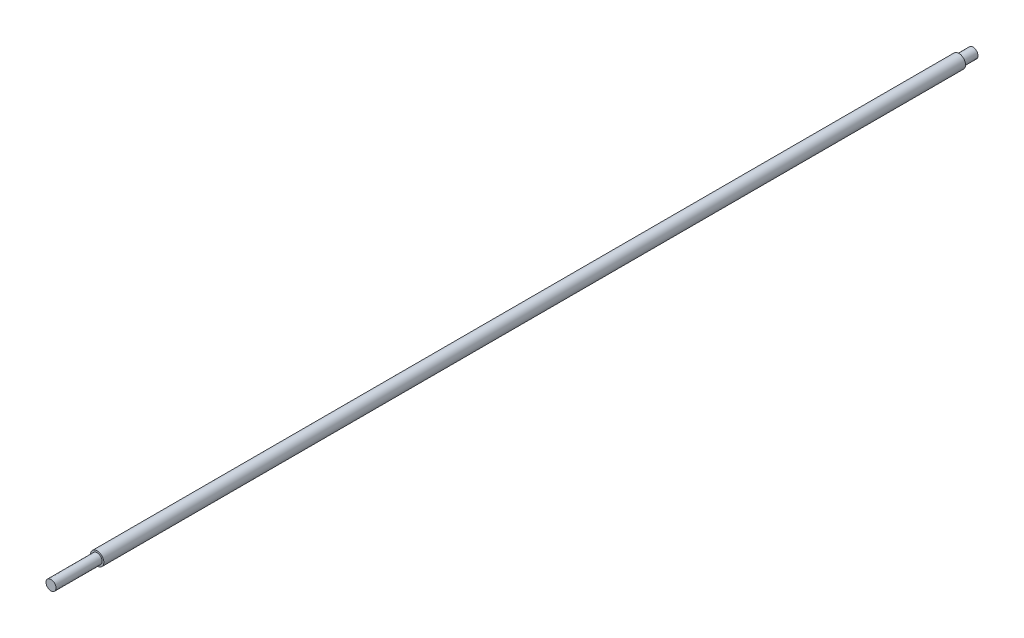
ISO-10303-21;
HEADER;
FILE_DESCRIPTION(('STEP AP214'),'2;1');
FILE_NAME('part.step','',(''),(''),'','','');
FILE_SCHEMA(('AUTOMOTIVE_DESIGN { 1 0 10303 214 1 1 1 1 }'));
ENDSEC;
DATA;
#1=APPLICATION_CONTEXT('core data for automotive mechanical design processes');
#2=APPLICATION_PROTOCOL_DEFINITION('international standard','automotive_design',2000,#1);
#3=PRODUCT_CONTEXT('',#1,'mechanical');
#4=PRODUCT('Part','Part','',(#3));
#5=PRODUCT_RELATED_PRODUCT_CATEGORY('part','',(#4));
#6=PRODUCT_DEFINITION_FORMATION('','',#4);
#7=PRODUCT_DEFINITION_CONTEXT('part definition',#1,'design');
#8=PRODUCT_DEFINITION('design','',#6,#7);
#9=PRODUCT_DEFINITION_SHAPE('','',#8);
#10=(LENGTH_UNIT() NAMED_UNIT(*) SI_UNIT(.MILLI.,.METRE.));
#11=(NAMED_UNIT(*) PLANE_ANGLE_UNIT() SI_UNIT($,.RADIAN.));
#12=(NAMED_UNIT(*) SI_UNIT($,.STERADIAN.) SOLID_ANGLE_UNIT());
#13=UNCERTAINTY_MEASURE_WITH_UNIT(LENGTH_MEASURE(1.E-05),#10,'distance_accuracy_value','');
#14=(GEOMETRIC_REPRESENTATION_CONTEXT(3) GLOBAL_UNCERTAINTY_ASSIGNED_CONTEXT((#13)) GLOBAL_UNIT_ASSIGNED_CONTEXT((#10,
#11,#12)) REPRESENTATION_CONTEXT('',''));
#15=CARTESIAN_POINT('',(0.,0.,0.));
#16=DIRECTION('',(0.,0.,1.));
#17=DIRECTION('',(1.,0.,0.));
#18=AXIS2_PLACEMENT_3D('',#15,#16,#17);
#19=CARTESIAN_POINT('',(0.,0.,1102.));
#20=DIRECTION('',(0.,0.,-1.));
#21=DIRECTION('',(-1.,0.,0.));
#22=AXIS2_PLACEMENT_3D('',#19,#20,#21);
#23=CYLINDRICAL_SURFACE('',#22,8.);
#24=CARTESIAN_POINT('',(0.,0.,1051.));
#25=DIRECTION('',(0.,0.,1.));
#26=DIRECTION('',(1.,0.,0.));
#27=AXIS2_PLACEMENT_3D('',#24,#25,#26);
#28=CIRCLE('',#27,8.);
#29=CARTESIAN_POINT('',(8.,0.,1051.));
#30=VERTEX_POINT('',#29);
#31=EDGE_CURVE('E46',#30,#30,#28,.T.);
#32=ORIENTED_EDGE('',*,*,#31,.F.);
#33=EDGE_LOOP('',(#32));
#34=FACE_BOUND('',#33,.T.);
#35=CARTESIAN_POINT('',(0.,0.,17.));
#36=DIRECTION('',(0.,0.,-1.));
#37=DIRECTION('',(-1.,0.,0.));
#38=AXIS2_PLACEMENT_3D('',#35,#36,#37);
#39=CIRCLE('',#38,8.);
#40=CARTESIAN_POINT('',(-8.,0.,17.));
#41=VERTEX_POINT('',#40);
#42=EDGE_CURVE('E49',#41,#41,#39,.T.);
#43=ORIENTED_EDGE('',*,*,#42,.F.);
#44=EDGE_LOOP('',(#43));
#45=FACE_BOUND('',#44,.T.);
#46=ADVANCED_FACE('F27',(#34,#45),#23,.T.);
#47=CARTESIAN_POINT('',(0.,0.,1051.));
#48=DIRECTION('',(0.,0.,1.));
#49=DIRECTION('',(1.,0.,0.));
#50=AXIS2_PLACEMENT_3D('',#47,#48,#49);
#51=PLANE('',#50);
#52=ORIENTED_EDGE('',*,*,#31,.T.);
#53=EDGE_LOOP('',(#52));
#54=FACE_BOUND('',#53,.T.);
#55=CARTESIAN_POINT('',(0.,0.,1051.));
#56=DIRECTION('',(0.,0.,1.));
#57=DIRECTION('',(1.,0.,0.));
#58=AXIS2_PLACEMENT_3D('',#55,#56,#57);
#59=CIRCLE('',#58,6.);
#60=CARTESIAN_POINT('',(6.,0.,1051.));
#61=VERTEX_POINT('',#60);
#62=EDGE_CURVE('E33',#61,#61,#59,.F.);
#63=ORIENTED_EDGE('',*,*,#62,.T.);
#64=EDGE_LOOP('',(#63));
#65=FACE_BOUND('',#64,.T.);
#66=ADVANCED_FACE('F56',(#54,#65),#51,.T.);
#67=CARTESIAN_POINT('',(0.,0.,1106.4));
#68=DIRECTION('',(0.,0.,1.));
#69=DIRECTION('',(1.,0.,0.));
#70=AXIS2_PLACEMENT_3D('',#67,#68,#69);
#71=PLANE('',#70);
#72=CARTESIAN_POINT('',(0.,0.,1106.4));
#73=DIRECTION('',(0.,0.,1.));
#74=DIRECTION('',(1.,0.,0.));
#75=AXIS2_PLACEMENT_3D('',#72,#73,#74);
#76=CIRCLE('',#75,6.);
#77=CARTESIAN_POINT('',(6.,0.,1106.4));
#78=VERTEX_POINT('',#77);
#79=EDGE_CURVE('E41',#78,#78,#76,.T.);
#80=ORIENTED_EDGE('',*,*,#79,.T.);
#81=EDGE_LOOP('',(#80));
#82=FACE_BOUND('',#81,.T.);
#83=ADVANCED_FACE('F63',(#82),#71,.T.);
#84=CARTESIAN_POINT('',(0.,0.,1048.));
#85=DIRECTION('',(0.,0.,1.));
#86=DIRECTION('',(1.,0.,0.));
#87=AXIS2_PLACEMENT_3D('',#84,#85,#86);
#88=CYLINDRICAL_SURFACE('',#87,6.);
#89=ORIENTED_EDGE('',*,*,#62,.F.);
#90=EDGE_LOOP('',(#89));
#91=FACE_BOUND('',#90,.T.);
#92=ORIENTED_EDGE('',*,*,#79,.F.);
#93=EDGE_LOOP('',(#92));
#94=FACE_BOUND('',#93,.T.);
#95=ADVANCED_FACE('F70',(#91,#94),#88,.T.);
#96=CARTESIAN_POINT('',(0.,0.,17.));
#97=DIRECTION('',(0.,0.,-1.));
#98=DIRECTION('',(-1.,0.,0.));
#99=AXIS2_PLACEMENT_3D('',#96,#97,#98);
#100=PLANE('',#99);
#101=ORIENTED_EDGE('',*,*,#42,.T.);
#102=EDGE_LOOP('',(#101));
#103=FACE_BOUND('',#102,.T.);
#104=CARTESIAN_POINT('',(0.,0.,17.));
#105=DIRECTION('',(0.,0.,-1.));
#106=DIRECTION('',(-1.,0.,0.));
#107=AXIS2_PLACEMENT_3D('',#104,#105,#106);
#108=CIRCLE('',#107,6.);
#109=CARTESIAN_POINT('',(-6.,0.,17.));
#110=VERTEX_POINT('',#109);
#111=EDGE_CURVE('E10',#110,#110,#108,.F.);
#112=ORIENTED_EDGE('',*,*,#111,.T.);
#113=EDGE_LOOP('',(#112));
#114=FACE_BOUND('',#113,.T.);
#115=ADVANCED_FACE('F53',(#103,#114),#100,.T.);
#116=CARTESIAN_POINT('',(0.,0.,0.));
#117=DIRECTION('',(0.,0.,1.));
#118=DIRECTION('',(1.,0.,0.));
#119=AXIS2_PLACEMENT_3D('',#116,#117,#118);
#120=PLANE('',#119);
#121=CARTESIAN_POINT('',(0.,0.,0.));
#122=DIRECTION('',(0.,0.,-1.));
#123=DIRECTION('',(-1.,0.,0.));
#124=AXIS2_PLACEMENT_3D('',#121,#122,#123);
#125=CIRCLE('',#124,6.);
#126=CARTESIAN_POINT('',(-6.,0.,0.));
#127=VERTEX_POINT('',#126);
#128=EDGE_CURVE('E37',#127,#127,#125,.T.);
#129=ORIENTED_EDGE('',*,*,#128,.T.);
#130=EDGE_LOOP('',(#129));
#131=FACE_BOUND('',#130,.T.);
#132=ADVANCED_FACE('F78',(#131),#120,.F.);
#133=CARTESIAN_POINT('',(0.,0.,20.));
#134=DIRECTION('',(0.,0.,-1.));
#135=DIRECTION('',(-1.,0.,0.));
#136=AXIS2_PLACEMENT_3D('',#133,#134,#135);
#137=CYLINDRICAL_SURFACE('',#136,6.);
#138=ORIENTED_EDGE('',*,*,#111,.F.);
#139=EDGE_LOOP('',(#138));
#140=FACE_BOUND('',#139,.T.);
#141=ORIENTED_EDGE('',*,*,#128,.F.);
#142=EDGE_LOOP('',(#141));
#143=FACE_BOUND('',#142,.T.);
#144=ADVANCED_FACE('F75',(#140,#143),#137,.T.);
#145=CLOSED_SHELL('',(#46,#66,#83,#95,#115,#132,#144));
#146=MANIFOLD_SOLID_BREP('B2',#145);
#147=ADVANCED_BREP_SHAPE_REPRESENTATION('',(#18,#146),#14);
#148=SHAPE_DEFINITION_REPRESENTATION(#9,#147);
ENDSEC;
END-ISO-10303-21;
